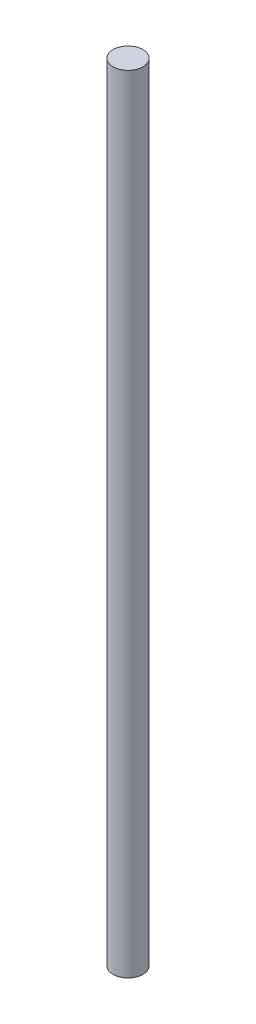
ISO-10303-21;
HEADER;
FILE_DESCRIPTION(('STEP AP214'),'2;1');
FILE_NAME('part.step','',(''),(''),'','','');
FILE_SCHEMA(('AUTOMOTIVE_DESIGN { 1 0 10303 214 1 1 1 1 }'));
ENDSEC;
DATA;
#1=APPLICATION_CONTEXT('core data for automotive mechanical design processes');
#2=APPLICATION_PROTOCOL_DEFINITION('international standard','automotive_design',2000,#1);
#3=PRODUCT_CONTEXT('',#1,'mechanical');
#4=PRODUCT('Part','Part','',(#3));
#5=PRODUCT_RELATED_PRODUCT_CATEGORY('part','',(#4));
#6=PRODUCT_DEFINITION_FORMATION('','',#4);
#7=PRODUCT_DEFINITION_CONTEXT('part definition',#1,'design');
#8=PRODUCT_DEFINITION('design','',#6,#7);
#9=PRODUCT_DEFINITION_SHAPE('','',#8);
#10=(LENGTH_UNIT() NAMED_UNIT(*) SI_UNIT(.MILLI.,.METRE.));
#11=(NAMED_UNIT(*) PLANE_ANGLE_UNIT() SI_UNIT($,.RADIAN.));
#12=(NAMED_UNIT(*) SI_UNIT($,.STERADIAN.) SOLID_ANGLE_UNIT());
#13=UNCERTAINTY_MEASURE_WITH_UNIT(LENGTH_MEASURE(1.E-05),#10,'distance_accuracy_value','');
#14=(GEOMETRIC_REPRESENTATION_CONTEXT(3) GLOBAL_UNCERTAINTY_ASSIGNED_CONTEXT((#13)) GLOBAL_UNIT_ASSIGNED_CONTEXT((#10,
#11,#12)) REPRESENTATION_CONTEXT('',''));
#15=CARTESIAN_POINT('',(0.,0.,0.));
#16=DIRECTION('',(0.,0.,1.));
#17=DIRECTION('',(1.,0.,0.));
#18=AXIS2_PLACEMENT_3D('',#15,#16,#17);
#19=CARTESIAN_POINT('',(0.,39.5,0.));
#20=DIRECTION('',(0.,-1.,0.));
#21=DIRECTION('',(0.,0.,-1.));
#22=AXIS2_PLACEMENT_3D('',#19,#20,#21);
#23=CYLINDRICAL_SURFACE('',#22,0.75);
#24=CARTESIAN_POINT('',(0.,39.5,0.));
#25=DIRECTION('',(0.,1.,0.));
#26=DIRECTION('',(0.,0.,1.));
#27=AXIS2_PLACEMENT_3D('',#24,#25,#26);
#28=CIRCLE('',#27,0.75);
#29=CARTESIAN_POINT('',(0.,39.5,0.75));
#30=VERTEX_POINT('',#29);
#31=EDGE_CURVE('E10',#30,#30,#28,.T.);
#32=ORIENTED_EDGE('',*,*,#31,.F.);
#33=EDGE_LOOP('',(#32));
#34=FACE_BOUND('',#33,.T.);
#35=CARTESIAN_POINT('',(0.,0.,0.));
#36=DIRECTION('',(0.,1.,0.));
#37=DIRECTION('',(0.,0.,1.));
#38=AXIS2_PLACEMENT_3D('',#35,#36,#37);
#39=CIRCLE('',#38,0.75);
#40=CARTESIAN_POINT('',(0.,0.,0.75));
#41=VERTEX_POINT('',#40);
#42=EDGE_CURVE('E36',#41,#41,#39,.T.);
#43=ORIENTED_EDGE('',*,*,#42,.T.);
#44=EDGE_LOOP('',(#43));
#45=FACE_BOUND('',#44,.T.);
#46=ADVANCED_FACE('F33',(#34,#45),#23,.T.);
#47=CARTESIAN_POINT('',(0.,39.5,0.));
#48=DIRECTION('',(0.,1.,0.));
#49=DIRECTION('',(0.,0.,1.));
#50=AXIS2_PLACEMENT_3D('',#47,#48,#49);
#51=PLANE('',#50);
#52=ORIENTED_EDGE('',*,*,#31,.T.);
#53=EDGE_LOOP('',(#52));
#54=FACE_BOUND('',#53,.T.);
#55=ADVANCED_FACE('F48',(#54),#51,.T.);
#56=CARTESIAN_POINT('',(0.,0.,0.));
#57=DIRECTION('',(0.,1.,0.));
#58=DIRECTION('',(0.,0.,1.));
#59=AXIS2_PLACEMENT_3D('',#56,#57,#58);
#60=PLANE('',#59);
#61=ORIENTED_EDGE('',*,*,#42,.F.);
#62=EDGE_LOOP('',(#61));
#63=FACE_BOUND('',#62,.T.);
#64=ADVANCED_FACE('F46',(#63),#60,.F.);
#65=CLOSED_SHELL('',(#46,#55,#64));
#66=MANIFOLD_SOLID_BREP('B2',#65);
#67=ADVANCED_BREP_SHAPE_REPRESENTATION('',(#18,#66),#14);
#68=SHAPE_DEFINITION_REPRESENTATION(#9,#67);
ENDSEC;
END-ISO-10303-21;
